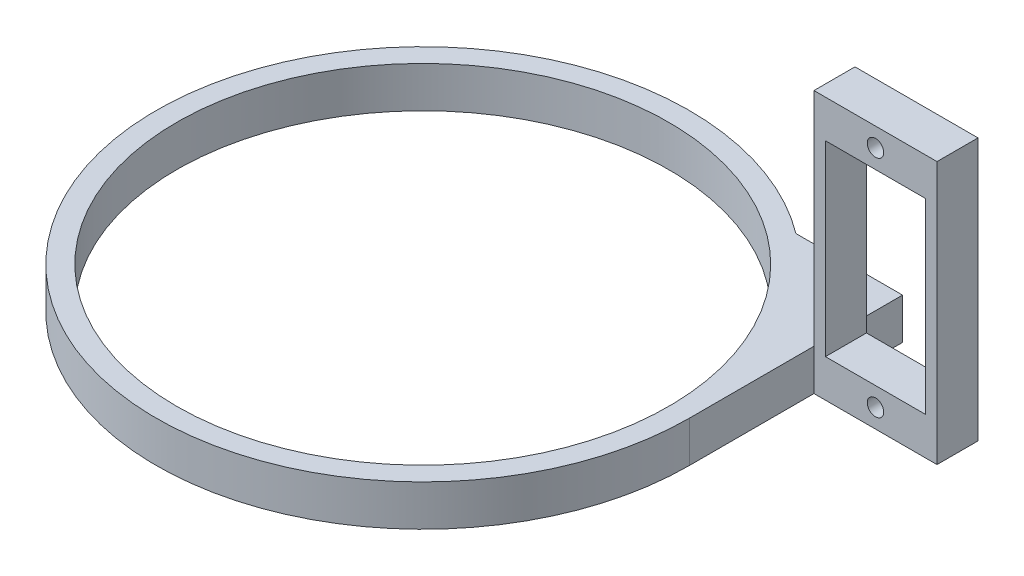
ISO-10303-21;
HEADER;
FILE_DESCRIPTION(('STEP AP214'),'2;1');
FILE_NAME('part.step','',(''),(''),'','','');
FILE_SCHEMA(('AUTOMOTIVE_DESIGN { 1 0 10303 214 1 1 1 1 }'));
ENDSEC;
DATA;
#1=APPLICATION_CONTEXT('core data for automotive mechanical design processes');
#2=APPLICATION_PROTOCOL_DEFINITION('international standard','automotive_design',2000,#1);
#3=PRODUCT_CONTEXT('',#1,'mechanical');
#4=PRODUCT('Part','Part','',(#3));
#5=PRODUCT_RELATED_PRODUCT_CATEGORY('part','',(#4));
#6=PRODUCT_DEFINITION_FORMATION('','',#4);
#7=PRODUCT_DEFINITION_CONTEXT('part definition',#1,'design');
#8=PRODUCT_DEFINITION('design','',#6,#7);
#9=PRODUCT_DEFINITION_SHAPE('','',#8);
#10=(LENGTH_UNIT() NAMED_UNIT(*) SI_UNIT(.MILLI.,.METRE.));
#11=(NAMED_UNIT(*) PLANE_ANGLE_UNIT() SI_UNIT($,.RADIAN.));
#12=(NAMED_UNIT(*) SI_UNIT($,.STERADIAN.) SOLID_ANGLE_UNIT());
#13=UNCERTAINTY_MEASURE_WITH_UNIT(LENGTH_MEASURE(1.E-05),#10,'distance_accuracy_value','');
#14=(GEOMETRIC_REPRESENTATION_CONTEXT(3) GLOBAL_UNCERTAINTY_ASSIGNED_CONTEXT((#13)) GLOBAL_UNIT_ASSIGNED_CONTEXT((#10,
#11,#12)) REPRESENTATION_CONTEXT('',''));
#15=CARTESIAN_POINT('',(0.,0.,0.));
#16=DIRECTION('',(0.,0.,1.));
#17=DIRECTION('',(1.,0.,0.));
#18=AXIS2_PLACEMENT_3D('',#15,#16,#17);
#19=CARTESIAN_POINT('',(32.5,5.,0.));
#20=DIRECTION('',(-1.,0.,0.));
#21=DIRECTION('',(0.,0.,1.));
#22=AXIS2_PLACEMENT_3D('',#19,#20,#21);
#23=PLANE('',#22);
#24=DIRECTION('',(0.,-1.,0.));
#25=VECTOR('',#24,1.);
#26=CARTESIAN_POINT('',(32.5,5.,-15.2));
#27=LINE('',#26,#25);
#28=CARTESIAN_POINT('',(32.5,5.,-15.2));
#29=VERTEX_POINT('',#28);
#30=CARTESIAN_POINT('',(32.5,0.,-15.2));
#31=VERTEX_POINT('',#30);
#32=EDGE_CURVE('E11',#29,#31,#27,.T.);
#33=ORIENTED_EDGE('',*,*,#32,.F.);
#34=DIRECTION('',(0.,0.,-1.));
#35=VECTOR('',#34,1.);
#36=CARTESIAN_POINT('',(32.5,5.,0.));
#37=LINE('',#36,#35);
#38=CARTESIAN_POINT('',(32.5,5.,0.));
#39=VERTEX_POINT('',#38);
#40=EDGE_CURVE('E258',#39,#29,#37,.T.);
#41=ORIENTED_EDGE('',*,*,#40,.F.);
#42=DIRECTION('',(0.,-1.,0.));
#43=VECTOR('',#42,1.);
#44=CARTESIAN_POINT('',(32.5,5.,0.));
#45=LINE('',#44,#43);
#46=CARTESIAN_POINT('',(32.5,0.,0.));
#47=VERTEX_POINT('',#46);
#48=EDGE_CURVE('E282',#39,#47,#45,.T.);
#49=ORIENTED_EDGE('',*,*,#48,.T.);
#50=DIRECTION('',(0.,0.,-1.));
#51=VECTOR('',#50,1.);
#52=CARTESIAN_POINT('',(32.5,0.,0.));
#53=LINE('',#52,#51);
#54=EDGE_CURVE('E270',#47,#31,#53,.T.);
#55=ORIENTED_EDGE('',*,*,#54,.T.);
#56=EDGE_LOOP('',(#33,#41,#49,#55));
#57=FACE_BOUND('',#56,.T.);
#58=ADVANCED_FACE('F45',(#57),#23,.F.);
#59=CARTESIAN_POINT('',(0.,5.,0.));
#60=DIRECTION('',(0.,1.,0.));
#61=DIRECTION('',(0.,0.,1.));
#62=AXIS2_PLACEMENT_3D('',#59,#60,#61);
#63=PLANE('',#62);
#64=CARTESIAN_POINT('',(0.,5.,0.));
#65=DIRECTION('',(0.,1.,0.));
#66=DIRECTION('',(0.,0.,1.));
#67=AXIS2_PLACEMENT_3D('',#64,#65,#66);
#68=CIRCLE('',#67,32.5);
#69=CARTESIAN_POINT('',(19.5,5.,-26.));
#70=VERTEX_POINT('',#69);
#71=EDGE_CURVE('E253',#70,#39,#68,.T.);
#72=ORIENTED_EDGE('',*,*,#71,.T.);
#73=ORIENTED_EDGE('',*,*,#40,.T.);
#74=CARTESIAN_POINT('',(32.5,5.,-20.2));
#75=VERTEX_POINT('',#74);
#76=EDGE_CURVE('E262',#29,#75,#37,.T.);
#77=ORIENTED_EDGE('',*,*,#76,.T.);
#78=CARTESIAN_POINT('',(32.5,5.,-26.));
#79=VERTEX_POINT('',#78);
#80=EDGE_CURVE('E61',#75,#79,#37,.T.);
#81=ORIENTED_EDGE('',*,*,#80,.T.);
#82=DIRECTION('',(-1.,0.,0.));
#83=VECTOR('',#82,1.);
#84=CARTESIAN_POINT('',(32.5,5.,-26.));
#85=LINE('',#84,#83);
#86=EDGE_CURVE('E261',#79,#70,#85,.T.);
#87=ORIENTED_EDGE('',*,*,#86,.T.);
#88=EDGE_LOOP('',(#72,#73,#77,#81,#87));
#89=FACE_BOUND('',#88,.T.);
#90=CARTESIAN_POINT('',(0.,5.,0.));
#91=DIRECTION('',(0.,1.,0.));
#92=DIRECTION('',(0.,0.,1.));
#93=AXIS2_PLACEMENT_3D('',#90,#91,#92);
#94=CIRCLE('',#93,30.);
#95=CARTESIAN_POINT('',(0.,5.,30.));
#96=VERTEX_POINT('',#95);
#97=EDGE_CURVE('E245',#96,#96,#94,.T.);
#98=ORIENTED_EDGE('',*,*,#97,.F.);
#99=EDGE_LOOP('',(#98));
#100=FACE_BOUND('',#99,.T.);
#101=ADVANCED_FACE('F306',(#89,#100),#63,.T.);
#102=CARTESIAN_POINT('',(0.,0.,0.));
#103=DIRECTION('',(0.,1.,0.));
#104=DIRECTION('',(0.,0.,1.));
#105=AXIS2_PLACEMENT_3D('',#102,#103,#104);
#106=PLANE('',#105);
#107=CARTESIAN_POINT('',(0.,0.,0.));
#108=DIRECTION('',(0.,1.,0.));
#109=DIRECTION('',(0.,0.,1.));
#110=AXIS2_PLACEMENT_3D('',#107,#108,#109);
#111=CIRCLE('',#110,32.5);
#112=CARTESIAN_POINT('',(19.5,0.,-26.));
#113=VERTEX_POINT('',#112);
#114=EDGE_CURVE('E249',#113,#47,#111,.T.);
#115=ORIENTED_EDGE('',*,*,#114,.F.);
#116=DIRECTION('',(-1.,0.,0.));
#117=VECTOR('',#116,1.);
#118=CARTESIAN_POINT('',(32.5,0.,-26.));
#119=LINE('',#118,#117);
#120=CARTESIAN_POINT('',(32.5,0.,-26.));
#121=VERTEX_POINT('',#120);
#122=EDGE_CURVE('E257',#121,#113,#119,.T.);
#123=ORIENTED_EDGE('',*,*,#122,.F.);
#124=CARTESIAN_POINT('',(32.5,0.,-20.2));
#125=VERTEX_POINT('',#124);
#126=EDGE_CURVE('E269',#125,#121,#53,.T.);
#127=ORIENTED_EDGE('',*,*,#126,.F.);
#128=DIRECTION('',(1.,0.,0.));
#129=VECTOR('',#128,1.);
#130=CARTESIAN_POINT('',(47.5,0.,-20.2));
#131=LINE('',#130,#129);
#132=CARTESIAN_POINT('',(47.5,0.,-20.2));
#133=VERTEX_POINT('',#132);
#134=EDGE_CURVE('E201',#125,#133,#131,.T.);
#135=ORIENTED_EDGE('',*,*,#134,.T.);
#136=DIRECTION('',(0.,0.,-1.));
#137=VECTOR('',#136,1.);
#138=CARTESIAN_POINT('',(47.5,0.,-15.2));
#139=LINE('',#138,#137);
#140=CARTESIAN_POINT('',(47.5,0.,-15.2));
#141=VERTEX_POINT('',#140);
#142=EDGE_CURVE('E240',#141,#133,#139,.T.);
#143=ORIENTED_EDGE('',*,*,#142,.F.);
#144=DIRECTION('',(1.,0.,0.));
#145=VECTOR('',#144,1.);
#146=CARTESIAN_POINT('',(47.5,0.,-15.2));
#147=LINE('',#146,#145);
#148=EDGE_CURVE('E205',#31,#141,#147,.T.);
#149=ORIENTED_EDGE('',*,*,#148,.F.);
#150=ORIENTED_EDGE('',*,*,#54,.F.);
#151=EDGE_LOOP('',(#115,#123,#127,#135,#143,#149,#150));
#152=FACE_BOUND('',#151,.T.);
#153=CARTESIAN_POINT('',(0.,0.,0.));
#154=DIRECTION('',(0.,1.,0.));
#155=DIRECTION('',(0.,0.,1.));
#156=AXIS2_PLACEMENT_3D('',#153,#154,#155);
#157=CIRCLE('',#156,30.);
#158=CARTESIAN_POINT('',(0.,0.,30.));
#159=VERTEX_POINT('',#158);
#160=EDGE_CURVE('E244',#159,#159,#157,.T.);
#161=ORIENTED_EDGE('',*,*,#160,.T.);
#162=EDGE_LOOP('',(#161));
#163=FACE_BOUND('',#162,.T.);
#164=ADVANCED_FACE('F297',(#152,#163),#106,.F.);
#165=CARTESIAN_POINT('',(0.,5.,0.));
#166=DIRECTION('',(0.,-1.,0.));
#167=DIRECTION('',(0.,0.,-1.));
#168=AXIS2_PLACEMENT_3D('',#165,#166,#167);
#169=CYLINDRICAL_SURFACE('',#168,32.5);
#170=ORIENTED_EDGE('',*,*,#114,.T.);
#171=ORIENTED_EDGE('',*,*,#48,.F.);
#172=ORIENTED_EDGE('',*,*,#71,.F.);
#173=DIRECTION('',(0.,-1.,0.));
#174=VECTOR('',#173,1.);
#175=CARTESIAN_POINT('',(19.5,5.,-26.));
#176=LINE('',#175,#174);
#177=EDGE_CURVE('E265',#70,#113,#176,.T.);
#178=ORIENTED_EDGE('',*,*,#177,.T.);
#179=EDGE_LOOP('',(#170,#171,#172,#178));
#180=FACE_BOUND('',#179,.T.);
#181=ADVANCED_FACE('F47',(#180),#169,.T.);
#182=ORIENTED_EDGE('',*,*,#80,.F.);
#183=DIRECTION('',(0.,-1.,0.));
#184=VECTOR('',#183,1.);
#185=CARTESIAN_POINT('',(32.5,5.,-20.2));
#186=LINE('',#185,#184);
#187=EDGE_CURVE('E54',#75,#125,#186,.T.);
#188=ORIENTED_EDGE('',*,*,#187,.T.);
#189=ORIENTED_EDGE('',*,*,#126,.T.);
#190=DIRECTION('',(0.,-1.,0.));
#191=VECTOR('',#190,1.);
#192=CARTESIAN_POINT('',(32.5,5.,-26.));
#193=LINE('',#192,#191);
#194=EDGE_CURVE('E278',#79,#121,#193,.T.);
#195=ORIENTED_EDGE('',*,*,#194,.F.);
#196=EDGE_LOOP('',(#182,#188,#189,#195));
#197=FACE_BOUND('',#196,.T.);
#198=ADVANCED_FACE('F288',(#197),#23,.F.);
#199=CARTESIAN_POINT('',(32.5,5.,-26.));
#200=DIRECTION('',(0.,0.,1.));
#201=DIRECTION('',(1.,0.,0.));
#202=AXIS2_PLACEMENT_3D('',#199,#200,#201);
#203=PLANE('',#202);
#204=ORIENTED_EDGE('',*,*,#122,.T.);
#205=ORIENTED_EDGE('',*,*,#177,.F.);
#206=ORIENTED_EDGE('',*,*,#86,.F.);
#207=ORIENTED_EDGE('',*,*,#194,.T.);
#208=EDGE_LOOP('',(#204,#205,#206,#207));
#209=FACE_BOUND('',#208,.T.);
#210=ADVANCED_FACE('F325',(#209),#203,.F.);
#211=CARTESIAN_POINT('',(0.,5.,0.));
#212=DIRECTION('',(0.,-1.,0.));
#213=DIRECTION('',(0.,0.,-1.));
#214=AXIS2_PLACEMENT_3D('',#211,#212,#213);
#215=CYLINDRICAL_SURFACE('',#214,30.);
#216=ORIENTED_EDGE('',*,*,#97,.T.);
#217=EDGE_LOOP('',(#216));
#218=FACE_BOUND('',#217,.T.);
#219=ORIENTED_EDGE('',*,*,#160,.F.);
#220=EDGE_LOOP('',(#219));
#221=FACE_BOUND('',#220,.T.);
#222=ADVANCED_FACE('F327',(#218,#221),#215,.F.);
#223=CARTESIAN_POINT('',(0.,0.,-15.2));
#224=DIRECTION('',(0.,0.,-1.));
#225=DIRECTION('',(-1.,0.,0.));
#226=AXIS2_PLACEMENT_3D('',#223,#224,#225);
#227=PLANE('',#226);
#228=CARTESIAN_POINT('',(40.,2.3,-15.2));
#229=DIRECTION('',(0.,0.,1.));
#230=DIRECTION('',(-1.,0.,0.));
#231=AXIS2_PLACEMENT_3D('',#228,#229,#230);
#232=CIRCLE('',#231,1.00000000000001);
#233=CARTESIAN_POINT('',(39.,2.3,-15.2));
#234=VERTEX_POINT('',#233);
#235=EDGE_CURVE('E189',#234,#234,#232,.T.);
#236=ORIENTED_EDGE('',*,*,#235,.F.);
#237=EDGE_LOOP('',(#236));
#238=FACE_BOUND('',#237,.T.);
#239=CARTESIAN_POINT('',(40.,29.7,-15.2));
#240=DIRECTION('',(0.,0.,1.));
#241=DIRECTION('',(1.,0.,0.));
#242=AXIS2_PLACEMENT_3D('',#239,#240,#241);
#243=CIRCLE('',#242,1.00000000000001);
#244=CARTESIAN_POINT('',(41.,29.7,-15.2));
#245=VERTEX_POINT('',#244);
#246=EDGE_CURVE('E197',#245,#245,#243,.T.);
#247=ORIENTED_EDGE('',*,*,#246,.F.);
#248=EDGE_LOOP('',(#247));
#249=FACE_BOUND('',#248,.T.);
#250=ORIENTED_EDGE('',*,*,#148,.T.);
#251=DIRECTION('',(0.,1.,0.));
#252=VECTOR('',#251,1.);
#253=CARTESIAN_POINT('',(47.5,32.,-15.2));
#254=LINE('',#253,#252);
#255=CARTESIAN_POINT('',(47.5,32.,-15.2));
#256=VERTEX_POINT('',#255);
#257=EDGE_CURVE('E209',#141,#256,#254,.T.);
#258=ORIENTED_EDGE('',*,*,#257,.T.);
#259=DIRECTION('',(-1.,0.,0.));
#260=VECTOR('',#259,1.);
#261=CARTESIAN_POINT('',(32.5,32.,-15.2));
#262=LINE('',#261,#260);
#263=CARTESIAN_POINT('',(32.5,32.,-15.2));
#264=VERTEX_POINT('',#263);
#265=EDGE_CURVE('E213',#256,#264,#262,.T.);
#266=ORIENTED_EDGE('',*,*,#265,.T.);
#267=DIRECTION('',(0.,-1.,0.));
#268=VECTOR('',#267,1.);
#269=CARTESIAN_POINT('',(32.5,0.,-15.2));
#270=LINE('',#269,#268);
#271=EDGE_CURVE('E216',#264,#29,#270,.T.);
#272=ORIENTED_EDGE('',*,*,#271,.T.);
#273=ORIENTED_EDGE('',*,*,#32,.T.);
#274=EDGE_LOOP('',(#250,#258,#266,#272,#273));
#275=FACE_BOUND('',#274,.T.);
#276=DIRECTION('',(0.,1.,0.));
#277=VECTOR('',#276,1.);
#278=CARTESIAN_POINT('',(46.1,4.60000000000001,-15.2));
#279=LINE('',#278,#277);
#280=CARTESIAN_POINT('',(46.1,4.60000000000001,-15.2));
#281=VERTEX_POINT('',#280);
#282=CARTESIAN_POINT('',(46.1,27.4,-15.2));
#283=VERTEX_POINT('',#282);
#284=EDGE_CURVE('E135',#281,#283,#279,.T.);
#285=ORIENTED_EDGE('',*,*,#284,.F.);
#286=DIRECTION('',(1.,0.,0.));
#287=VECTOR('',#286,1.);
#288=CARTESIAN_POINT('',(33.9,4.60000000000001,-15.2));
#289=LINE('',#288,#287);
#290=CARTESIAN_POINT('',(33.9,4.60000000000001,-15.2));
#291=VERTEX_POINT('',#290);
#292=EDGE_CURVE('E165',#291,#281,#289,.T.);
#293=ORIENTED_EDGE('',*,*,#292,.F.);
#294=DIRECTION('',(0.,-1.,0.));
#295=VECTOR('',#294,1.);
#296=CARTESIAN_POINT('',(33.9,4.60000000000001,-15.2));
#297=LINE('',#296,#295);
#298=CARTESIAN_POINT('',(33.9,27.4,-15.2));
#299=VERTEX_POINT('',#298);
#300=EDGE_CURVE('E161',#299,#291,#297,.T.);
#301=ORIENTED_EDGE('',*,*,#300,.F.);
#302=DIRECTION('',(-1.,0.,0.));
#303=VECTOR('',#302,1.);
#304=CARTESIAN_POINT('',(33.9,27.4,-15.2));
#305=LINE('',#304,#303);
#306=EDGE_CURVE('E146',#283,#299,#305,.T.);
#307=ORIENTED_EDGE('',*,*,#306,.F.);
#308=EDGE_LOOP('',(#285,#293,#301,#307));
#309=FACE_BOUND('',#308,.T.);
#310=ADVANCED_FACE('F159',(#238,#249,#275,#309),#227,.F.);
#311=CARTESIAN_POINT('',(0.,0.,-20.2));
#312=DIRECTION('',(0.,0.,-1.));
#313=DIRECTION('',(-1.,0.,0.));
#314=AXIS2_PLACEMENT_3D('',#311,#312,#313);
#315=PLANE('',#314);
#316=CARTESIAN_POINT('',(40.,29.7,-20.2));
#317=DIRECTION('',(0.,0.,1.));
#318=DIRECTION('',(1.,0.,0.));
#319=AXIS2_PLACEMENT_3D('',#316,#317,#318);
#320=CIRCLE('',#319,1.00000000000001);
#321=CARTESIAN_POINT('',(41.,29.7,-20.2));
#322=VERTEX_POINT('',#321);
#323=EDGE_CURVE('E193',#322,#322,#320,.T.);
#324=ORIENTED_EDGE('',*,*,#323,.T.);
#325=EDGE_LOOP('',(#324));
#326=FACE_BOUND('',#325,.T.);
#327=ORIENTED_EDGE('',*,*,#134,.F.);
#328=ORIENTED_EDGE('',*,*,#187,.F.);
#329=DIRECTION('',(0.,-1.,0.));
#330=VECTOR('',#329,1.);
#331=CARTESIAN_POINT('',(32.5,0.,-20.2));
#332=LINE('',#331,#330);
#333=CARTESIAN_POINT('',(32.5,32.,-20.2));
#334=VERTEX_POINT('',#333);
#335=EDGE_CURVE('E210',#334,#75,#332,.T.);
#336=ORIENTED_EDGE('',*,*,#335,.F.);
#337=DIRECTION('',(-1.,0.,0.));
#338=VECTOR('',#337,1.);
#339=CARTESIAN_POINT('',(32.5,32.,-20.2));
#340=LINE('',#339,#338);
#341=CARTESIAN_POINT('',(47.5,32.,-20.2));
#342=VERTEX_POINT('',#341);
#343=EDGE_CURVE('E227',#342,#334,#340,.T.);
#344=ORIENTED_EDGE('',*,*,#343,.F.);
#345=DIRECTION('',(0.,1.,0.));
#346=VECTOR('',#345,1.);
#347=CARTESIAN_POINT('',(47.5,32.,-20.2));
#348=LINE('',#347,#346);
#349=EDGE_CURVE('E224',#133,#342,#348,.T.);
#350=ORIENTED_EDGE('',*,*,#349,.F.);
#351=EDGE_LOOP('',(#327,#328,#336,#344,#350));
#352=FACE_BOUND('',#351,.T.);
#353=CARTESIAN_POINT('',(40.,2.3,-20.2));
#354=DIRECTION('',(0.,0.,1.));
#355=DIRECTION('',(-1.,0.,0.));
#356=AXIS2_PLACEMENT_3D('',#353,#354,#355);
#357=CIRCLE('',#356,1.00000000000001);
#358=CARTESIAN_POINT('',(39.,2.3,-20.2));
#359=VERTEX_POINT('',#358);
#360=EDGE_CURVE('E155',#359,#359,#357,.T.);
#361=ORIENTED_EDGE('',*,*,#360,.T.);
#362=EDGE_LOOP('',(#361));
#363=FACE_BOUND('',#362,.T.);
#364=DIRECTION('',(1.,0.,0.));
#365=VECTOR('',#364,1.);
#366=CARTESIAN_POINT('',(33.9,4.60000000000001,-20.2));
#367=LINE('',#366,#365);
#368=CARTESIAN_POINT('',(33.9,4.60000000000001,-20.2));
#369=VERTEX_POINT('',#368);
#370=CARTESIAN_POINT('',(46.1,4.60000000000001,-20.2));
#371=VERTEX_POINT('',#370);
#372=EDGE_CURVE('E147',#369,#371,#367,.T.);
#373=ORIENTED_EDGE('',*,*,#372,.T.);
#374=DIRECTION('',(0.,1.,0.));
#375=VECTOR('',#374,1.);
#376=CARTESIAN_POINT('',(46.1,4.60000000000001,-20.2));
#377=LINE('',#376,#375);
#378=CARTESIAN_POINT('',(46.1,27.4,-20.2));
#379=VERTEX_POINT('',#378);
#380=EDGE_CURVE('E170',#371,#379,#377,.T.);
#381=ORIENTED_EDGE('',*,*,#380,.T.);
#382=DIRECTION('',(-1.,0.,0.));
#383=VECTOR('',#382,1.);
#384=CARTESIAN_POINT('',(33.9,27.4,-20.2));
#385=LINE('',#384,#383);
#386=CARTESIAN_POINT('',(33.9,27.4,-20.2));
#387=VERTEX_POINT('',#386);
#388=EDGE_CURVE('E153',#379,#387,#385,.T.);
#389=ORIENTED_EDGE('',*,*,#388,.T.);
#390=DIRECTION('',(0.,-1.,0.));
#391=VECTOR('',#390,1.);
#392=CARTESIAN_POINT('',(33.9,4.60000000000001,-20.2));
#393=LINE('',#392,#391);
#394=EDGE_CURVE('E175',#387,#369,#393,.T.);
#395=ORIENTED_EDGE('',*,*,#394,.T.);
#396=EDGE_LOOP('',(#373,#381,#389,#395));
#397=FACE_BOUND('',#396,.T.);
#398=ADVANCED_FACE('F291',(#326,#352,#363,#397),#315,.T.);
#399=CARTESIAN_POINT('',(47.5,32.,-15.2));
#400=DIRECTION('',(-1.,0.,0.));
#401=DIRECTION('',(0.,0.,1.));
#402=AXIS2_PLACEMENT_3D('',#399,#400,#401);
#403=PLANE('',#402);
#404=ORIENTED_EDGE('',*,*,#349,.T.);
#405=DIRECTION('',(0.,0.,-1.));
#406=VECTOR('',#405,1.);
#407=CARTESIAN_POINT('',(47.5,32.,-15.2));
#408=LINE('',#407,#406);
#409=EDGE_CURVE('E236',#256,#342,#408,.T.);
#410=ORIENTED_EDGE('',*,*,#409,.F.);
#411=ORIENTED_EDGE('',*,*,#257,.F.);
#412=ORIENTED_EDGE('',*,*,#142,.T.);
#413=EDGE_LOOP('',(#404,#410,#411,#412));
#414=FACE_BOUND('',#413,.T.);
#415=ADVANCED_FACE('F318',(#414),#403,.F.);
#416=CARTESIAN_POINT('',(32.5,32.,-15.2));
#417=DIRECTION('',(0.,-1.,0.));
#418=DIRECTION('',(0.,0.,-1.));
#419=AXIS2_PLACEMENT_3D('',#416,#417,#418);
#420=PLANE('',#419);
#421=ORIENTED_EDGE('',*,*,#343,.T.);
#422=DIRECTION('',(0.,0.,-1.));
#423=VECTOR('',#422,1.);
#424=CARTESIAN_POINT('',(32.5,32.,-15.2));
#425=LINE('',#424,#423);
#426=EDGE_CURVE('E220',#264,#334,#425,.T.);
#427=ORIENTED_EDGE('',*,*,#426,.F.);
#428=ORIENTED_EDGE('',*,*,#265,.F.);
#429=ORIENTED_EDGE('',*,*,#409,.T.);
#430=EDGE_LOOP('',(#421,#427,#428,#429));
#431=FACE_BOUND('',#430,.T.);
#432=ADVANCED_FACE('F316',(#431),#420,.F.);
#433=CARTESIAN_POINT('',(32.5,0.,-15.2));
#434=DIRECTION('',(1.,0.,0.));
#435=DIRECTION('',(0.,0.,-1.));
#436=AXIS2_PLACEMENT_3D('',#433,#434,#435);
#437=PLANE('',#436);
#438=ORIENTED_EDGE('',*,*,#76,.F.);
#439=ORIENTED_EDGE('',*,*,#271,.F.);
#440=ORIENTED_EDGE('',*,*,#426,.T.);
#441=ORIENTED_EDGE('',*,*,#335,.T.);
#442=EDGE_LOOP('',(#438,#439,#440,#441));
#443=FACE_BOUND('',#442,.T.);
#444=ADVANCED_FACE('F310',(#443),#437,.F.);
#445=CARTESIAN_POINT('',(40.,29.7,-15.2));
#446=DIRECTION('',(0.,0.,-1.));
#447=DIRECTION('',(-1.,0.,0.));
#448=AXIS2_PLACEMENT_3D('',#445,#446,#447);
#449=CYLINDRICAL_SURFACE('',#448,1.00000000000001);
#450=ORIENTED_EDGE('',*,*,#246,.T.);
#451=EDGE_LOOP('',(#450));
#452=FACE_BOUND('',#451,.T.);
#453=ORIENTED_EDGE('',*,*,#323,.F.);
#454=EDGE_LOOP('',(#453));
#455=FACE_BOUND('',#454,.T.);
#456=ADVANCED_FACE('F352',(#452,#455),#449,.F.);
#457=CARTESIAN_POINT('',(40.,2.3,-15.2));
#458=DIRECTION('',(0.,0.,-1.));
#459=DIRECTION('',(-1.,0.,0.));
#460=AXIS2_PLACEMENT_3D('',#457,#458,#459);
#461=CYLINDRICAL_SURFACE('',#460,1.00000000000001);
#462=ORIENTED_EDGE('',*,*,#235,.T.);
#463=EDGE_LOOP('',(#462));
#464=FACE_BOUND('',#463,.T.);
#465=ORIENTED_EDGE('',*,*,#360,.F.);
#466=EDGE_LOOP('',(#465));
#467=FACE_BOUND('',#466,.T.);
#468=ADVANCED_FACE('F361',(#464,#467),#461,.F.);
#469=CARTESIAN_POINT('',(46.1,4.60000000000001,-15.2));
#470=DIRECTION('',(-1.,0.,0.));
#471=DIRECTION('',(0.,-1.,0.));
#472=AXIS2_PLACEMENT_3D('',#469,#470,#471);
#473=PLANE('',#472);
#474=ORIENTED_EDGE('',*,*,#380,.F.);
#475=DIRECTION('',(0.,0.,-1.));
#476=VECTOR('',#475,1.);
#477=CARTESIAN_POINT('',(46.1,4.60000000000001,-15.2));
#478=LINE('',#477,#476);
#479=EDGE_CURVE('E141',#281,#371,#478,.T.);
#480=ORIENTED_EDGE('',*,*,#479,.F.);
#481=ORIENTED_EDGE('',*,*,#284,.T.);
#482=DIRECTION('',(0.,0.,-1.));
#483=VECTOR('',#482,1.);
#484=CARTESIAN_POINT('',(46.1,27.4,-15.2));
#485=LINE('',#484,#483);
#486=EDGE_CURVE('E138',#283,#379,#485,.T.);
#487=ORIENTED_EDGE('',*,*,#486,.T.);
#488=EDGE_LOOP('',(#474,#480,#481,#487));
#489=FACE_BOUND('',#488,.T.);
#490=ADVANCED_FACE('F137',(#489),#473,.T.);
#491=CARTESIAN_POINT('',(33.9,27.4,-15.2));
#492=DIRECTION('',(0.,-1.,0.));
#493=DIRECTION('',(1.,0.,0.));
#494=AXIS2_PLACEMENT_3D('',#491,#492,#493);
#495=PLANE('',#494);
#496=ORIENTED_EDGE('',*,*,#388,.F.);
#497=ORIENTED_EDGE('',*,*,#486,.F.);
#498=ORIENTED_EDGE('',*,*,#306,.T.);
#499=DIRECTION('',(0.,0.,-1.));
#500=VECTOR('',#499,1.);
#501=CARTESIAN_POINT('',(33.9,27.4,-15.2));
#502=LINE('',#501,#500);
#503=EDGE_CURVE('E156',#299,#387,#502,.T.);
#504=ORIENTED_EDGE('',*,*,#503,.T.);
#505=EDGE_LOOP('',(#496,#497,#498,#504));
#506=FACE_BOUND('',#505,.T.);
#507=ADVANCED_FACE('F150',(#506),#495,.T.);
#508=CARTESIAN_POINT('',(33.9,4.60000000000001,-15.2));
#509=DIRECTION('',(1.,0.,0.));
#510=DIRECTION('',(0.,0.,-1.));
#511=AXIS2_PLACEMENT_3D('',#508,#509,#510);
#512=PLANE('',#511);
#513=ORIENTED_EDGE('',*,*,#394,.F.);
#514=ORIENTED_EDGE('',*,*,#503,.F.);
#515=ORIENTED_EDGE('',*,*,#300,.T.);
#516=DIRECTION('',(0.,0.,-1.));
#517=VECTOR('',#516,1.);
#518=CARTESIAN_POINT('',(33.9,4.60000000000001,-15.2));
#519=LINE('',#518,#517);
#520=EDGE_CURVE('E184',#291,#369,#519,.T.);
#521=ORIENTED_EDGE('',*,*,#520,.T.);
#522=EDGE_LOOP('',(#513,#514,#515,#521));
#523=FACE_BOUND('',#522,.T.);
#524=ADVANCED_FACE('F370',(#523),#512,.T.);
#525=CARTESIAN_POINT('',(33.9,4.60000000000001,-15.2));
#526=DIRECTION('',(0.,1.,0.));
#527=DIRECTION('',(0.,0.,1.));
#528=AXIS2_PLACEMENT_3D('',#525,#526,#527);
#529=PLANE('',#528);
#530=ORIENTED_EDGE('',*,*,#372,.F.);
#531=ORIENTED_EDGE('',*,*,#520,.F.);
#532=ORIENTED_EDGE('',*,*,#292,.T.);
#533=ORIENTED_EDGE('',*,*,#479,.T.);
#534=EDGE_LOOP('',(#530,#531,#532,#533));
#535=FACE_BOUND('',#534,.T.);
#536=ADVANCED_FACE('F373',(#535),#529,.T.);
#537=CLOSED_SHELL('',(#58,#101,#164,#181,#198,#210,#222,#310,#398,#415,#432,#444,#456,#468,#490,
#507,#524,#536));
#538=MANIFOLD_SOLID_BREP('B2',#537);
#539=ADVANCED_BREP_SHAPE_REPRESENTATION('',(#18,#538),#14);
#540=SHAPE_DEFINITION_REPRESENTATION(#9,#539);
ENDSEC;
END-ISO-10303-21;
